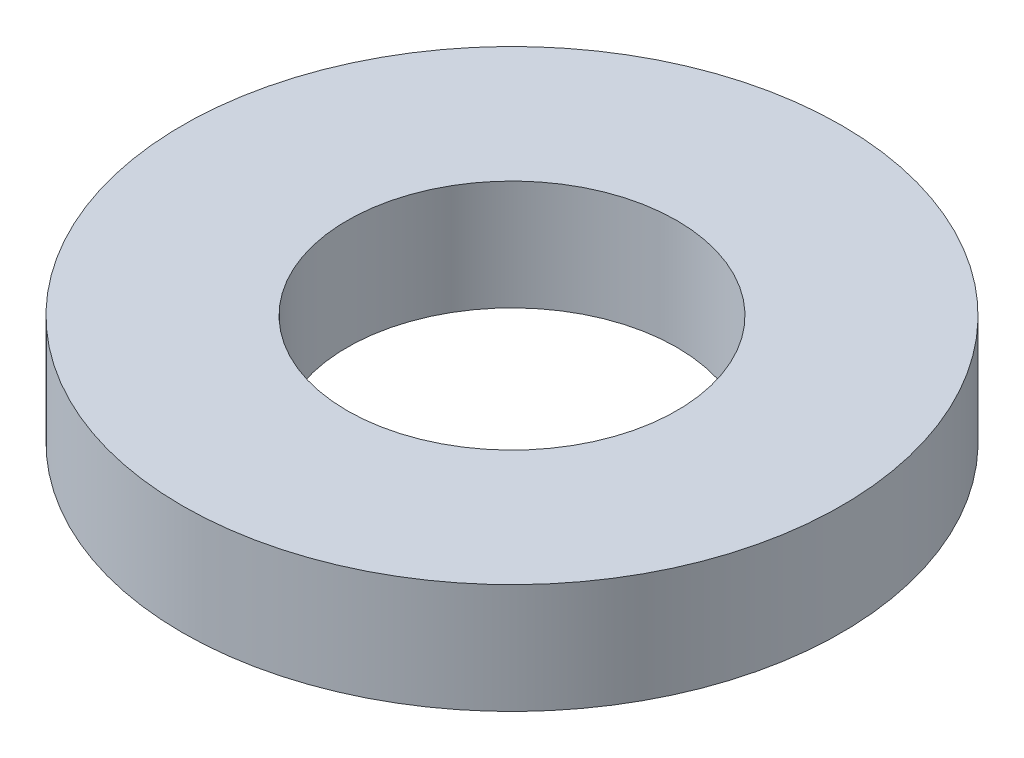
ISO-10303-21;
HEADER;
FILE_DESCRIPTION(('STEP AP214'),'2;1');
FILE_NAME('part.step','',(''),(''),'','','');
FILE_SCHEMA(('AUTOMOTIVE_DESIGN { 1 0 10303 214 1 1 1 1 }'));
ENDSEC;
DATA;
#1=APPLICATION_CONTEXT('core data for automotive mechanical design processes');
#2=APPLICATION_PROTOCOL_DEFINITION('international standard','automotive_design',2000,#1);
#3=PRODUCT_CONTEXT('',#1,'mechanical');
#4=PRODUCT('Part','Part','',(#3));
#5=PRODUCT_RELATED_PRODUCT_CATEGORY('part','',(#4));
#6=PRODUCT_DEFINITION_FORMATION('','',#4);
#7=PRODUCT_DEFINITION_CONTEXT('part definition',#1,'design');
#8=PRODUCT_DEFINITION('design','',#6,#7);
#9=PRODUCT_DEFINITION_SHAPE('','',#8);
#10=(LENGTH_UNIT() NAMED_UNIT(*) SI_UNIT(.MILLI.,.METRE.));
#11=(NAMED_UNIT(*) PLANE_ANGLE_UNIT() SI_UNIT($,.RADIAN.));
#12=(NAMED_UNIT(*) SI_UNIT($,.STERADIAN.) SOLID_ANGLE_UNIT());
#13=UNCERTAINTY_MEASURE_WITH_UNIT(LENGTH_MEASURE(1.E-05),#10,'distance_accuracy_value','');
#14=(GEOMETRIC_REPRESENTATION_CONTEXT(3) GLOBAL_UNCERTAINTY_ASSIGNED_CONTEXT((#13)) GLOBAL_UNIT_ASSIGNED_CONTEXT((#10,
#11,#12)) REPRESENTATION_CONTEXT('',''));
#15=CARTESIAN_POINT('',(0.,0.,0.));
#16=DIRECTION('',(0.,0.,1.));
#17=DIRECTION('',(1.,0.,0.));
#18=AXIS2_PLACEMENT_3D('',#15,#16,#17);
#19=CARTESIAN_POINT('',(0.,1.,0.));
#20=DIRECTION('',(0.,1.,0.));
#21=DIRECTION('',(0.,0.,1.));
#22=AXIS2_PLACEMENT_3D('',#19,#20,#21);
#23=PLANE('',#22);
#24=CARTESIAN_POINT('',(0.,1.,0.));
#25=DIRECTION('',(0.,1.,0.));
#26=DIRECTION('',(0.,0.,1.));
#27=AXIS2_PLACEMENT_3D('',#24,#25,#26);
#28=CIRCLE('',#27,3.);
#29=CARTESIAN_POINT('',(0.,1.,3.));
#30=VERTEX_POINT('',#29);
#31=EDGE_CURVE('E10',#30,#30,#28,.T.);
#32=ORIENTED_EDGE('',*,*,#31,.T.);
#33=EDGE_LOOP('',(#32));
#34=FACE_BOUND('',#33,.T.);
#35=CARTESIAN_POINT('',(0.,1.,0.));
#36=DIRECTION('',(0.,1.,0.));
#37=DIRECTION('',(0.,0.,1.));
#38=AXIS2_PLACEMENT_3D('',#35,#36,#37);
#39=CIRCLE('',#38,1.5);
#40=CARTESIAN_POINT('',(0.,1.,1.5));
#41=VERTEX_POINT('',#40);
#42=EDGE_CURVE('E43',#41,#41,#39,.T.);
#43=ORIENTED_EDGE('',*,*,#42,.F.);
#44=EDGE_LOOP('',(#43));
#45=FACE_BOUND('',#44,.T.);
#46=ADVANCED_FACE('F32',(#34,#45),#23,.T.);
#47=CARTESIAN_POINT('',(0.,0.,0.));
#48=DIRECTION('',(0.,1.,0.));
#49=DIRECTION('',(0.,0.,1.));
#50=AXIS2_PLACEMENT_3D('',#47,#48,#49);
#51=PLANE('',#50);
#52=CARTESIAN_POINT('',(0.,0.,0.));
#53=DIRECTION('',(0.,1.,0.));
#54=DIRECTION('',(0.,0.,1.));
#55=AXIS2_PLACEMENT_3D('',#52,#53,#54);
#56=CIRCLE('',#55,3.);
#57=CARTESIAN_POINT('',(0.,0.,3.));
#58=VERTEX_POINT('',#57);
#59=EDGE_CURVE('E36',#58,#58,#56,.T.);
#60=ORIENTED_EDGE('',*,*,#59,.F.);
#61=EDGE_LOOP('',(#60));
#62=FACE_BOUND('',#61,.T.);
#63=CARTESIAN_POINT('',(0.,0.,0.));
#64=DIRECTION('',(0.,1.,0.));
#65=DIRECTION('',(0.,0.,1.));
#66=AXIS2_PLACEMENT_3D('',#63,#64,#65);
#67=CIRCLE('',#66,1.5);
#68=CARTESIAN_POINT('',(0.,0.,1.5));
#69=VERTEX_POINT('',#68);
#70=EDGE_CURVE('E45',#69,#69,#67,.T.);
#71=ORIENTED_EDGE('',*,*,#70,.T.);
#72=EDGE_LOOP('',(#71));
#73=FACE_BOUND('',#72,.T.);
#74=ADVANCED_FACE('F55',(#62,#73),#51,.F.);
#75=CARTESIAN_POINT('',(0.,1.,0.));
#76=DIRECTION('',(0.,-1.,0.));
#77=DIRECTION('',(0.,0.,-1.));
#78=AXIS2_PLACEMENT_3D('',#75,#76,#77);
#79=CYLINDRICAL_SURFACE('',#78,3.);
#80=ORIENTED_EDGE('',*,*,#31,.F.);
#81=EDGE_LOOP('',(#80));
#82=FACE_BOUND('',#81,.T.);
#83=ORIENTED_EDGE('',*,*,#59,.T.);
#84=EDGE_LOOP('',(#83));
#85=FACE_BOUND('',#84,.T.);
#86=ADVANCED_FACE('F34',(#82,#85),#79,.T.);
#87=CARTESIAN_POINT('',(0.,1.,0.));
#88=DIRECTION('',(0.,-1.,0.));
#89=DIRECTION('',(0.,0.,-1.));
#90=AXIS2_PLACEMENT_3D('',#87,#88,#89);
#91=CYLINDRICAL_SURFACE('',#90,1.5);
#92=ORIENTED_EDGE('',*,*,#42,.T.);
#93=EDGE_LOOP('',(#92));
#94=FACE_BOUND('',#93,.T.);
#95=ORIENTED_EDGE('',*,*,#70,.F.);
#96=EDGE_LOOP('',(#95));
#97=FACE_BOUND('',#96,.T.);
#98=ADVANCED_FACE('F51',(#94,#97),#91,.F.);
#99=CLOSED_SHELL('',(#46,#74,#86,#98));
#100=MANIFOLD_SOLID_BREP('B2',#99);
#101=ADVANCED_BREP_SHAPE_REPRESENTATION('',(#18,#100),#14);
#102=SHAPE_DEFINITION_REPRESENTATION(#9,#101);
ENDSEC;
END-ISO-10303-21;
